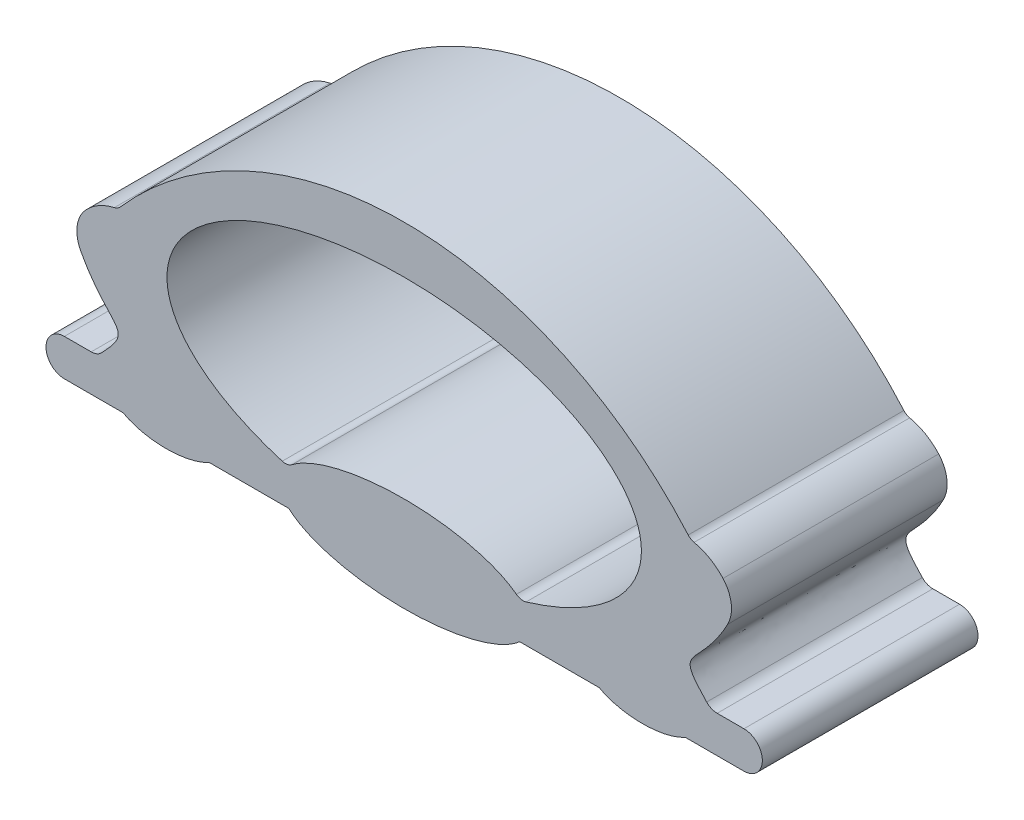
ISO-10303-21;
HEADER;
FILE_DESCRIPTION(('STEP AP214'),'2;1');
FILE_NAME('part.step','',(''),(''),'','','');
FILE_SCHEMA(('AUTOMOTIVE_DESIGN { 1 0 10303 214 1 1 1 1 }'));
ENDSEC;
DATA;
#1=APPLICATION_CONTEXT('core data for automotive mechanical design processes');
#2=APPLICATION_PROTOCOL_DEFINITION('international standard','automotive_design',2000,#1);
#3=PRODUCT_CONTEXT('',#1,'mechanical');
#4=PRODUCT('Part','Part','',(#3));
#5=PRODUCT_RELATED_PRODUCT_CATEGORY('part','',(#4));
#6=PRODUCT_DEFINITION_FORMATION('','',#4);
#7=PRODUCT_DEFINITION_CONTEXT('part definition',#1,'design');
#8=PRODUCT_DEFINITION('design','',#6,#7);
#9=PRODUCT_DEFINITION_SHAPE('','',#8);
#10=(LENGTH_UNIT() NAMED_UNIT(*) SI_UNIT(.MILLI.,.METRE.));
#11=(NAMED_UNIT(*) PLANE_ANGLE_UNIT() SI_UNIT($,.RADIAN.));
#12=(NAMED_UNIT(*) SI_UNIT($,.STERADIAN.) SOLID_ANGLE_UNIT());
#13=UNCERTAINTY_MEASURE_WITH_UNIT(LENGTH_MEASURE(1.E-05),#10,'distance_accuracy_value','');
#14=(GEOMETRIC_REPRESENTATION_CONTEXT(3) GLOBAL_UNCERTAINTY_ASSIGNED_CONTEXT((#13)) GLOBAL_UNIT_ASSIGNED_CONTEXT((#10,
#11,#12)) REPRESENTATION_CONTEXT('',''));
#15=CARTESIAN_POINT('',(0.,0.,0.));
#16=DIRECTION('',(0.,0.,1.));
#17=DIRECTION('',(1.,0.,0.));
#18=AXIS2_PLACEMENT_3D('',#15,#16,#17);
#19=CARTESIAN_POINT('',(0.,0.220517822577264,-1.));
#20=DIRECTION('',(0.,0.,1.));
#21=DIRECTION('',(1.,0.,0.));
#22=AXIS2_PLACEMENT_3D('',#19,#20,#21);
#23=ELLIPSE('',#22,0.580458558653862,0.220517822577264);
#24=DIRECTION('',(0.,0.,1.));
#25=VECTOR('',#24,1.);
#26=SURFACE_OF_LINEAR_EXTRUSION('',#23,#25);
#27=CARTESIAN_POINT('',(0.,0.220517822577264,0.));
#28=DIRECTION('',(0.,0.,1.));
#29=DIRECTION('',(1.,0.,0.));
#30=AXIS2_PLACEMENT_3D('',#27,#28,#29);
#31=ELLIPSE('',#30,0.580458558653862,0.220517822577264);
#32=CARTESIAN_POINT('',(-0.535294671074078,0.135236836832835,0.));
#33=VERTEX_POINT('',#32);
#34=CARTESIAN_POINT('',(0.535294671074078,0.135236836832835,0.));
#35=VERTEX_POINT('',#34);
#36=EDGE_CURVE('E423',#33,#35,#31,.T.);
#37=ORIENTED_EDGE('',*,*,#36,.F.);
#38=DIRECTION('',(0.,0.,1.));
#39=VECTOR('',#38,1.);
#40=CARTESIAN_POINT('',(-0.535294671074078,0.135236836832835,-1.));
#41=LINE('',#40,#39);
#42=CARTESIAN_POINT('',(-0.535294671074078,0.135236836832835,-1.));
#43=VERTEX_POINT('',#42);
#44=EDGE_CURVE('E11',#43,#33,#41,.T.);
#45=ORIENTED_EDGE('',*,*,#44,.F.);
#46=CARTESIAN_POINT('',(0.535294671074078,0.135236836832835,-1.));
#47=VERTEX_POINT('',#46);
#48=EDGE_CURVE('E393',#43,#47,#23,.T.);
#49=ORIENTED_EDGE('',*,*,#48,.T.);
#50=DIRECTION('',(0.,0.,1.));
#51=VECTOR('',#50,1.);
#52=CARTESIAN_POINT('',(0.535294671074078,0.135236836832835,-1.));
#53=LINE('',#52,#51);
#54=EDGE_CURVE('E339',#47,#35,#53,.T.);
#55=ORIENTED_EDGE('',*,*,#54,.T.);
#56=EDGE_LOOP('',(#37,#45,#49,#55));
#57=FACE_BOUND('',#56,.T.);
#58=ADVANCED_FACE('F39',(#57),#26,.T.);
#59=CARTESIAN_POINT('',(0.,0.135236836832809,-1.));
#60=DIRECTION('',(0.,-1.,0.));
#61=DIRECTION('',(1.,0.,0.));
#62=AXIS2_PLACEMENT_3D('',#59,#60,#61);
#63=PLANE('',#62);
#64=DIRECTION('',(1.,0.,0.));
#65=VECTOR('',#64,1.);
#66=CARTESIAN_POINT('',(0.,0.135236836832809,0.));
#67=LINE('',#66,#65);
#68=CARTESIAN_POINT('',(-0.904615000195535,0.135236836832853,0.));
#69=VERTEX_POINT('',#68);
#70=EDGE_CURVE('E352',#69,#33,#67,.T.);
#71=ORIENTED_EDGE('',*,*,#70,.F.);
#72=DIRECTION('',(0.,0.,1.));
#73=VECTOR('',#72,1.);
#74=CARTESIAN_POINT('',(-0.904615000195535,0.135236836832853,-1.));
#75=LINE('',#74,#73);
#76=CARTESIAN_POINT('',(-0.904615000195535,0.135236836832853,-1.));
#77=VERTEX_POINT('',#76);
#78=EDGE_CURVE('E49',#77,#69,#75,.T.);
#79=ORIENTED_EDGE('',*,*,#78,.F.);
#80=DIRECTION('',(1.,0.,0.));
#81=VECTOR('',#80,1.);
#82=CARTESIAN_POINT('',(0.,0.135236836832809,-1.));
#83=LINE('',#82,#81);
#84=EDGE_CURVE('E235',#77,#43,#83,.T.);
#85=ORIENTED_EDGE('',*,*,#84,.T.);
#86=ORIENTED_EDGE('',*,*,#44,.T.);
#87=EDGE_LOOP('',(#71,#79,#85,#86));
#88=FACE_BOUND('',#87,.T.);
#89=ADVANCED_FACE('F250',(#88),#63,.T.);
#90=CARTESIAN_POINT('',(-1.1040831308892,0.220517822577264,-1.));
#91=DIRECTION('',(0.,0.,1.));
#92=DIRECTION('',(1.,0.,0.));
#93=AXIS2_PLACEMENT_3D('',#90,#91,#92);
#94=ELLIPSE('',#93,0.264817394698102,0.129653963539522);
#95=DIRECTION('',(0.,0.,1.));
#96=VECTOR('',#95,1.);
#97=SURFACE_OF_LINEAR_EXTRUSION('',#94,#96);
#98=CARTESIAN_POINT('',(-1.1040831308892,0.220517822577264,0.));
#99=DIRECTION('',(0.,0.,1.));
#100=DIRECTION('',(1.,0.,0.));
#101=AXIS2_PLACEMENT_3D('',#98,#99,#100);
#102=ELLIPSE('',#101,0.264817394698102,0.129653963539522);
#103=CARTESIAN_POINT('',(-1.30355126158283,0.135236836832835,0.));
#104=VERTEX_POINT('',#103);
#105=EDGE_CURVE('E222',#104,#69,#102,.T.);
#106=ORIENTED_EDGE('',*,*,#105,.F.);
#107=DIRECTION('',(0.,0.,1.));
#108=VECTOR('',#107,1.);
#109=CARTESIAN_POINT('',(-1.30355126158283,0.135236836832835,-1.));
#110=LINE('',#109,#108);
#111=CARTESIAN_POINT('',(-1.30355126158283,0.135236836832835,-1.));
#112=VERTEX_POINT('',#111);
#113=EDGE_CURVE('E217',#112,#104,#110,.T.);
#114=ORIENTED_EDGE('',*,*,#113,.F.);
#115=EDGE_CURVE('E220',#112,#77,#94,.T.);
#116=ORIENTED_EDGE('',*,*,#115,.T.);
#117=ORIENTED_EDGE('',*,*,#78,.T.);
#118=EDGE_LOOP('',(#106,#114,#116,#117));
#119=FACE_BOUND('',#118,.T.);
#120=ADVANCED_FACE('F219',(#119),#97,.T.);
#121=CARTESIAN_POINT('',(0.,0.135236836832835,-1.));
#122=DIRECTION('',(0.,-1.,0.));
#123=DIRECTION('',(1.,0.,0.));
#124=AXIS2_PLACEMENT_3D('',#121,#122,#123);
#125=PLANE('',#124);
#126=DIRECTION('',(1.,0.,0.));
#127=VECTOR('',#126,1.);
#128=CARTESIAN_POINT('',(0.,0.135236836832835,0.));
#129=LINE('',#128,#127);
#130=CARTESIAN_POINT('',(-1.57560128689191,0.135236836832835,0.));
#131=VERTEX_POINT('',#130);
#132=EDGE_CURVE('E358',#131,#104,#129,.T.);
#133=ORIENTED_EDGE('',*,*,#132,.F.);
#134=DIRECTION('',(0.,0.,1.));
#135=VECTOR('',#134,1.);
#136=CARTESIAN_POINT('',(-1.57560128689191,0.135236836832835,-1.));
#137=LINE('',#136,#135);
#138=CARTESIAN_POINT('',(-1.57560128689191,0.135236836832835,-1.));
#139=VERTEX_POINT('',#138);
#140=EDGE_CURVE('E227',#139,#131,#137,.T.);
#141=ORIENTED_EDGE('',*,*,#140,.F.);
#142=DIRECTION('',(1.,0.,0.));
#143=VECTOR('',#142,1.);
#144=CARTESIAN_POINT('',(0.,0.135236836832835,-1.));
#145=LINE('',#144,#143);
#146=EDGE_CURVE('E233',#139,#112,#145,.T.);
#147=ORIENTED_EDGE('',*,*,#146,.T.);
#148=ORIENTED_EDGE('',*,*,#113,.T.);
#149=EDGE_LOOP('',(#133,#141,#147,#148));
#150=FACE_BOUND('',#149,.T.);
#151=ADVANCED_FACE('F237',(#150),#125,.T.);
#152=CARTESIAN_POINT('',(-1.57560128689191,0.220517822577264,-1.));
#153=DIRECTION('',(0.,0.,1.));
#154=DIRECTION('',(1.,0.,0.));
#155=AXIS2_PLACEMENT_3D('',#152,#153,#154);
#156=CYLINDRICAL_SURFACE('',#155,0.0852809857444291);
#157=CARTESIAN_POINT('',(-1.57560128689191,0.220517822577264,0.));
#158=DIRECTION('',(0.,0.,1.));
#159=DIRECTION('',(1.,0.,0.));
#160=AXIS2_PLACEMENT_3D('',#157,#158,#159);
#161=CIRCLE('',#160,0.0852809857444291);
#162=CARTESIAN_POINT('',(-1.57560128689191,0.305798808321693,0.));
#163=VERTEX_POINT('',#162);
#164=EDGE_CURVE('E357',#163,#131,#161,.T.);
#165=ORIENTED_EDGE('',*,*,#164,.F.);
#166=DIRECTION('',(0.,0.,1.));
#167=VECTOR('',#166,1.);
#168=CARTESIAN_POINT('',(-1.57560128689191,0.305798808321693,-1.));
#169=LINE('',#168,#167);
#170=CARTESIAN_POINT('',(-1.57560128689191,0.305798808321693,-1.));
#171=VERTEX_POINT('',#170);
#172=EDGE_CURVE('E297',#171,#163,#169,.T.);
#173=ORIENTED_EDGE('',*,*,#172,.F.);
#174=CARTESIAN_POINT('',(-1.57560128689191,0.220517822577264,-1.));
#175=DIRECTION('',(0.,0.,1.));
#176=DIRECTION('',(1.,0.,0.));
#177=AXIS2_PLACEMENT_3D('',#174,#175,#176);
#178=CIRCLE('',#177,0.0852809857444291);
#179=EDGE_CURVE('E238',#171,#139,#178,.T.);
#180=ORIENTED_EDGE('',*,*,#179,.T.);
#181=ORIENTED_EDGE('',*,*,#140,.T.);
#182=EDGE_LOOP('',(#165,#173,#180,#181));
#183=FACE_BOUND('',#182,.T.);
#184=ADVANCED_FACE('F254',(#183),#156,.T.);
#185=CARTESIAN_POINT('',(0.,0.30579880832177,-1.));
#186=DIRECTION('',(0.,-1.,0.));
#187=DIRECTION('',(1.,0.,0.));
#188=AXIS2_PLACEMENT_3D('',#185,#186,#187);
#189=PLANE('',#188);
#190=DIRECTION('',(1.,0.,0.));
#191=VECTOR('',#190,1.);
#192=CARTESIAN_POINT('',(0.,0.30579880832177,0.));
#193=LINE('',#192,#191);
#194=CARTESIAN_POINT('',(-1.45135613250542,0.305798808321699,0.));
#195=VERTEX_POINT('',#194);
#196=EDGE_CURVE('E295',#163,#195,#193,.T.);
#197=ORIENTED_EDGE('',*,*,#196,.T.);
#198=DIRECTION('',(0.,0.,1.));
#199=VECTOR('',#198,1.);
#200=CARTESIAN_POINT('',(-1.45135613250542,0.305798808321699,-1.));
#201=LINE('',#200,#199);
#202=CARTESIAN_POINT('',(-1.45135613250542,0.305798808321699,-1.));
#203=VERTEX_POINT('',#202);
#204=EDGE_CURVE('E293',#203,#195,#201,.T.);
#205=ORIENTED_EDGE('',*,*,#204,.F.);
#206=DIRECTION('',(1.,0.,0.));
#207=VECTOR('',#206,1.);
#208=CARTESIAN_POINT('',(0.,0.30579880832177,-1.));
#209=LINE('',#208,#207);
#210=EDGE_CURVE('E240',#171,#203,#209,.T.);
#211=ORIENTED_EDGE('',*,*,#210,.F.);
#212=ORIENTED_EDGE('',*,*,#172,.T.);
#213=EDGE_LOOP('',(#197,#205,#211,#212));
#214=FACE_BOUND('',#213,.T.);
#215=ADVANCED_FACE('F257',(#214),#189,.F.);
#216=CARTESIAN_POINT('',(-1.45135613250542,0.3732693463049,-1.));
#217=DIRECTION('',(0.,0.,1.));
#218=DIRECTION('',(1.,0.,0.));
#219=AXIS2_PLACEMENT_3D('',#216,#217,#218);
#220=CYLINDRICAL_SURFACE('',#219,0.0674705379832007);
#221=CARTESIAN_POINT('',(-1.45135613250542,0.3732693463049,0.));
#222=DIRECTION('',(0.,0.,1.));
#223=DIRECTION('',(1.,0.,0.));
#224=AXIS2_PLACEMENT_3D('',#221,#222,#223);
#225=CIRCLE('',#224,0.0674705379832007);
#226=CARTESIAN_POINT('',(-1.40265291356174,0.326575985317852,0.));
#227=VERTEX_POINT('',#226);
#228=EDGE_CURVE('E364',#195,#227,#225,.T.);
#229=ORIENTED_EDGE('',*,*,#228,.T.);
#230=DIRECTION('',(0.,0.,1.));
#231=VECTOR('',#230,1.);
#232=CARTESIAN_POINT('',(-1.40265291356174,0.326575985317852,-1.));
#233=LINE('',#232,#231);
#234=CARTESIAN_POINT('',(-1.40265291356174,0.326575985317852,-1.));
#235=VERTEX_POINT('',#234);
#236=EDGE_CURVE('E298',#235,#227,#233,.T.);
#237=ORIENTED_EDGE('',*,*,#236,.F.);
#238=CARTESIAN_POINT('',(-1.45135613250542,0.3732693463049,-1.));
#239=DIRECTION('',(0.,0.,1.));
#240=DIRECTION('',(1.,0.,0.));
#241=AXIS2_PLACEMENT_3D('',#238,#239,#240);
#242=CIRCLE('',#241,0.0674705379832007);
#243=EDGE_CURVE('E280',#203,#235,#242,.T.);
#244=ORIENTED_EDGE('',*,*,#243,.F.);
#245=ORIENTED_EDGE('',*,*,#204,.T.);
#246=EDGE_LOOP('',(#229,#237,#244,#245));
#247=FACE_BOUND('',#246,.T.);
#248=ADVANCED_FACE('F261',(#247),#220,.F.);
#249=CARTESIAN_POINT('',(-1.40265291356174,0.326575985317852,-1.));
#250=CARTESIAN_POINT('',(-1.36013043213884,0.370928794346584,-1.));
#251=CARTESIAN_POINT('',(-1.27309133862232,0.474573616068999,-1.));
#252=CARTESIAN_POINT('',(-1.40582243463488,0.509874509454359,-1.));
#253=CARTESIAN_POINT('',(-1.5,0.687275792162555,-1.));
#254=B_SPLINE_CURVE_WITH_KNOTS('',3,(#249,#250,#251,#252,#253),.UNSPECIFIED.,.F.,.F.,(4,1,4),
(0.0427994642491913,0.330664192356272,1.),.UNSPECIFIED.);
#255=DIRECTION('',(0.,0.,1.));
#256=VECTOR('',#255,1.);
#257=SURFACE_OF_LINEAR_EXTRUSION('',#254,#256);
#258=CARTESIAN_POINT('',(-1.40265291356174,0.326575985317852,0.));
#259=CARTESIAN_POINT('',(-1.36013043213884,0.370928794346584,0.));
#260=CARTESIAN_POINT('',(-1.27309133862232,0.474573616068999,0.));
#261=CARTESIAN_POINT('',(-1.40582243463488,0.509874509454359,0.));
#262=CARTESIAN_POINT('',(-1.5,0.687275792162555,0.));
#263=B_SPLINE_CURVE_WITH_KNOTS('',3,(#258,#259,#260,#261,#262),.UNSPECIFIED.,.F.,.F.,(4,1,4),
(0.0427994642491913,0.330664192356272,1.),.UNSPECIFIED.);
#264=CARTESIAN_POINT('',(-1.5,0.687275792162555,0.));
#265=VERTEX_POINT('',#264);
#266=EDGE_CURVE('E477',#227,#265,#263,.T.);
#267=ORIENTED_EDGE('',*,*,#266,.T.);
#268=DIRECTION('',(0.,0.,1.));
#269=VECTOR('',#268,1.);
#270=CARTESIAN_POINT('',(-1.5,0.687275792162555,-1.));
#271=LINE('',#270,#269);
#272=CARTESIAN_POINT('',(-1.5,0.687275792162555,-1.));
#273=VERTEX_POINT('',#272);
#274=EDGE_CURVE('E302',#273,#265,#271,.T.);
#275=ORIENTED_EDGE('',*,*,#274,.F.);
#276=EDGE_CURVE('E273',#235,#273,#254,.T.);
#277=ORIENTED_EDGE('',*,*,#276,.F.);
#278=ORIENTED_EDGE('',*,*,#236,.T.);
#279=EDGE_LOOP('',(#267,#275,#277,#278));
#280=FACE_BOUND('',#279,.T.);
#281=ADVANCED_FACE('F265',(#280),#257,.F.);
#282=CARTESIAN_POINT('',(-1.36534545068431,0.758760267507349,-1.));
#283=DIRECTION('',(0.,0.,1.));
#284=DIRECTION('',(1.,0.,0.));
#285=AXIS2_PLACEMENT_3D('',#282,#283,#284);
#286=CYLINDRICAL_SURFACE('',#285,0.152452870969136);
#287=CARTESIAN_POINT('',(-1.36534545068431,0.758760267507349,0.));
#288=DIRECTION('',(0.,0.,1.));
#289=DIRECTION('',(1.,0.,0.));
#290=AXIS2_PLACEMENT_3D('',#287,#288,#289);
#291=CIRCLE('',#290,0.152452870969136);
#292=CARTESIAN_POINT('',(-1.4786032866393,0.860811923356355,0.));
#293=VERTEX_POINT('',#292);
#294=EDGE_CURVE('E474',#265,#293,#291,.F.);
#295=ORIENTED_EDGE('',*,*,#294,.T.);
#296=DIRECTION('',(0.,0.,1.));
#297=VECTOR('',#296,1.);
#298=CARTESIAN_POINT('',(-1.4786032866393,0.860811923356355,-1.));
#299=LINE('',#298,#297);
#300=CARTESIAN_POINT('',(-1.4786032866393,0.860811923356355,-1.));
#301=VERTEX_POINT('',#300);
#302=EDGE_CURVE('E308',#301,#293,#299,.T.);
#303=ORIENTED_EDGE('',*,*,#302,.F.);
#304=CARTESIAN_POINT('',(-1.36534545068431,0.758760267507349,-1.));
#305=DIRECTION('',(0.,0.,1.));
#306=DIRECTION('',(1.,0.,0.));
#307=AXIS2_PLACEMENT_3D('',#304,#305,#306);
#308=CIRCLE('',#307,0.152452870969136);
#309=EDGE_CURVE('E281',#273,#301,#308,.F.);
#310=ORIENTED_EDGE('',*,*,#309,.F.);
#311=ORIENTED_EDGE('',*,*,#274,.T.);
#312=EDGE_LOOP('',(#295,#303,#310,#311));
#313=FACE_BOUND('',#312,.T.);
#314=ADVANCED_FACE('F270',(#313),#286,.T.);
#315=CARTESIAN_POINT('',(-1.29111060359085,0.691870511017601,-1.));
#316=DIRECTION('',(0.,0.,1.));
#317=DIRECTION('',(1.,0.,0.));
#318=AXIS2_PLACEMENT_3D('',#315,#316,#317);
#319=CYLINDRICAL_SURFACE('',#318,0.252378103249312);
#320=CARTESIAN_POINT('',(-1.29111060359085,0.691870511017601,0.));
#321=DIRECTION('',(0.,0.,1.));
#322=DIRECTION('',(1.,0.,0.));
#323=AXIS2_PLACEMENT_3D('',#320,#321,#322);
#324=CIRCLE('',#323,0.252378103249312);
#325=CARTESIAN_POINT('',(-1.34423413804204,0.938594237252297,0.));
#326=VERTEX_POINT('',#325);
#327=EDGE_CURVE('E471',#293,#326,#324,.F.);
#328=ORIENTED_EDGE('',*,*,#327,.T.);
#329=DIRECTION('',(0.,0.,1.));
#330=VECTOR('',#329,1.);
#331=CARTESIAN_POINT('',(-1.34423413804204,0.938594237252297,-1.));
#332=LINE('',#331,#330);
#333=CARTESIAN_POINT('',(-1.34423413804204,0.938594237252297,-1.));
#334=VERTEX_POINT('',#333);
#335=EDGE_CURVE('E311',#334,#326,#332,.T.);
#336=ORIENTED_EDGE('',*,*,#335,.F.);
#337=CARTESIAN_POINT('',(-1.29111060359085,0.691870511017601,-1.));
#338=DIRECTION('',(0.,0.,1.));
#339=DIRECTION('',(1.,0.,0.));
#340=AXIS2_PLACEMENT_3D('',#337,#338,#339);
#341=CIRCLE('',#340,0.252378103249312);
#342=EDGE_CURVE('E488',#301,#334,#341,.F.);
#343=ORIENTED_EDGE('',*,*,#342,.F.);
#344=ORIENTED_EDGE('',*,*,#302,.T.);
#345=EDGE_LOOP('',(#328,#336,#343,#344));
#346=FACE_BOUND('',#345,.T.);
#347=ADVANCED_FACE('F492',(#346),#319,.T.);
#348=CARTESIAN_POINT('',(-1.35475873066067,0.98747401783908,-1.));
#349=DIRECTION('',(0.,0.,1.));
#350=DIRECTION('',(1.,0.,0.));
#351=AXIS2_PLACEMENT_3D('',#348,#349,#350);
#352=CYLINDRICAL_SURFACE('',#351,0.0499999999999999);
#353=CARTESIAN_POINT('',(-1.35475873066067,0.98747401783908,0.));
#354=DIRECTION('',(0.,0.,1.));
#355=DIRECTION('',(1.,0.,0.));
#356=AXIS2_PLACEMENT_3D('',#353,#354,#355);
#357=CIRCLE('',#356,0.0499999999999999);
#358=CARTESIAN_POINT('',(-1.31711319517699,0.954567883788615,0.));
#359=VERTEX_POINT('',#358);
#360=EDGE_CURVE('E468',#326,#359,#357,.T.);
#361=ORIENTED_EDGE('',*,*,#360,.T.);
#362=DIRECTION('',(0.,0.,1.));
#363=VECTOR('',#362,1.);
#364=CARTESIAN_POINT('',(-1.31711319517699,0.954567883788615,-1.));
#365=LINE('',#364,#363);
#366=CARTESIAN_POINT('',(-1.31711319517699,0.954567883788615,-1.));
#367=VERTEX_POINT('',#366);
#368=EDGE_CURVE('E314',#367,#359,#365,.T.);
#369=ORIENTED_EDGE('',*,*,#368,.F.);
#370=CARTESIAN_POINT('',(-1.35475873066067,0.98747401783908,-1.));
#371=DIRECTION('',(0.,0.,1.));
#372=DIRECTION('',(1.,0.,0.));
#373=AXIS2_PLACEMENT_3D('',#370,#371,#372);
#374=CIRCLE('',#373,0.0499999999999999);
#375=EDGE_CURVE('E493',#334,#367,#374,.T.);
#376=ORIENTED_EDGE('',*,*,#375,.F.);
#377=ORIENTED_EDGE('',*,*,#335,.T.);
#378=EDGE_LOOP('',(#361,#369,#376,#377));
#379=FACE_BOUND('',#378,.T.);
#380=ADVANCED_FACE('F570',(#379),#352,.F.);
#381=CARTESIAN_POINT('',(0.,-0.196726759872993,-1.));
#382=DIRECTION('',(0.,0.,1.));
#383=DIRECTION('',(1.,0.,0.));
#384=AXIS2_PLACEMENT_3D('',#381,#382,#383);
#385=CYLINDRICAL_SURFACE('',#384,1.74936174801933);
#386=CARTESIAN_POINT('',(0.,-0.196726759872993,0.));
#387=DIRECTION('',(0.,0.,1.));
#388=DIRECTION('',(1.,0.,0.));
#389=AXIS2_PLACEMENT_3D('',#386,#387,#388);
#390=CIRCLE('',#389,1.74936174801933);
#391=CARTESIAN_POINT('',(1.31711319517699,0.954567883788615,0.));
#392=VERTEX_POINT('',#391);
#393=EDGE_CURVE('E465',#392,#359,#390,.T.);
#394=ORIENTED_EDGE('',*,*,#393,.F.);
#395=DIRECTION('',(0.,0.,1.));
#396=VECTOR('',#395,1.);
#397=CARTESIAN_POINT('',(1.31711319517699,0.954567883788615,-1.));
#398=LINE('',#397,#396);
#399=CARTESIAN_POINT('',(1.31711319517699,0.954567883788615,-1.));
#400=VERTEX_POINT('',#399);
#401=EDGE_CURVE('E316',#400,#392,#398,.T.);
#402=ORIENTED_EDGE('',*,*,#401,.F.);
#403=CARTESIAN_POINT('',(0.,-0.196726759872993,-1.));
#404=DIRECTION('',(0.,0.,1.));
#405=DIRECTION('',(1.,0.,0.));
#406=AXIS2_PLACEMENT_3D('',#403,#404,#405);
#407=CIRCLE('',#406,1.74936174801933);
#408=EDGE_CURVE('E494',#400,#367,#407,.T.);
#409=ORIENTED_EDGE('',*,*,#408,.T.);
#410=ORIENTED_EDGE('',*,*,#368,.T.);
#411=EDGE_LOOP('',(#394,#402,#409,#410));
#412=FACE_BOUND('',#411,.T.);
#413=ADVANCED_FACE('F567',(#412),#385,.T.);
#414=CARTESIAN_POINT('',(1.35475873066067,0.98747401783908,-1.));
#415=DIRECTION('',(0.,0.,1.));
#416=DIRECTION('',(1.,0.,0.));
#417=AXIS2_PLACEMENT_3D('',#414,#415,#416);
#418=CYLINDRICAL_SURFACE('',#417,0.0499999999999999);
#419=CARTESIAN_POINT('',(1.35475873066067,0.98747401783908,0.));
#420=DIRECTION('',(0.,0.,1.));
#421=DIRECTION('',(1.,0.,0.));
#422=AXIS2_PLACEMENT_3D('',#419,#420,#421);
#423=CIRCLE('',#422,0.0499999999999999);
#424=CARTESIAN_POINT('',(1.34423413804204,0.938594237252297,0.));
#425=VERTEX_POINT('',#424);
#426=EDGE_CURVE('E462',#425,#392,#423,.F.);
#427=ORIENTED_EDGE('',*,*,#426,.F.);
#428=DIRECTION('',(0.,0.,1.));
#429=VECTOR('',#428,1.);
#430=CARTESIAN_POINT('',(1.34423413804204,0.938594237252297,-1.));
#431=LINE('',#430,#429);
#432=CARTESIAN_POINT('',(1.34423413804204,0.938594237252297,-1.));
#433=VERTEX_POINT('',#432);
#434=EDGE_CURVE('E318',#433,#425,#431,.T.);
#435=ORIENTED_EDGE('',*,*,#434,.F.);
#436=CARTESIAN_POINT('',(1.35475873066067,0.98747401783908,-1.));
#437=DIRECTION('',(0.,0.,1.));
#438=DIRECTION('',(1.,0.,0.));
#439=AXIS2_PLACEMENT_3D('',#436,#437,#438);
#440=CIRCLE('',#439,0.0499999999999999);
#441=EDGE_CURVE('E499',#433,#400,#440,.F.);
#442=ORIENTED_EDGE('',*,*,#441,.T.);
#443=ORIENTED_EDGE('',*,*,#401,.T.);
#444=EDGE_LOOP('',(#427,#435,#442,#443));
#445=FACE_BOUND('',#444,.T.);
#446=ADVANCED_FACE('F563',(#445),#418,.F.);
#447=CARTESIAN_POINT('',(1.29111060359085,0.691870511017601,-1.));
#448=DIRECTION('',(0.,0.,1.));
#449=DIRECTION('',(1.,0.,0.));
#450=AXIS2_PLACEMENT_3D('',#447,#448,#449);
#451=CYLINDRICAL_SURFACE('',#450,0.252378103249312);
#452=CARTESIAN_POINT('',(1.29111060359085,0.691870511017601,0.));
#453=DIRECTION('',(0.,0.,1.));
#454=DIRECTION('',(1.,0.,0.));
#455=AXIS2_PLACEMENT_3D('',#452,#453,#454);
#456=CIRCLE('',#455,0.252378103249312);
#457=CARTESIAN_POINT('',(1.4786032866393,0.860811923356355,0.));
#458=VERTEX_POINT('',#457);
#459=EDGE_CURVE('E459',#458,#425,#456,.T.);
#460=ORIENTED_EDGE('',*,*,#459,.F.);
#461=DIRECTION('',(0.,0.,1.));
#462=VECTOR('',#461,1.);
#463=CARTESIAN_POINT('',(1.4786032866393,0.860811923356355,-1.));
#464=LINE('',#463,#462);
#465=CARTESIAN_POINT('',(1.4786032866393,0.860811923356355,-1.));
#466=VERTEX_POINT('',#465);
#467=EDGE_CURVE('E320',#466,#458,#464,.T.);
#468=ORIENTED_EDGE('',*,*,#467,.F.);
#469=CARTESIAN_POINT('',(1.29111060359085,0.691870511017601,-1.));
#470=DIRECTION('',(0.,0.,1.));
#471=DIRECTION('',(1.,0.,0.));
#472=AXIS2_PLACEMENT_3D('',#469,#470,#471);
#473=CIRCLE('',#472,0.252378103249312);
#474=EDGE_CURVE('E502',#466,#433,#473,.T.);
#475=ORIENTED_EDGE('',*,*,#474,.T.);
#476=ORIENTED_EDGE('',*,*,#434,.T.);
#477=EDGE_LOOP('',(#460,#468,#475,#476));
#478=FACE_BOUND('',#477,.T.);
#479=ADVANCED_FACE('F559',(#478),#451,.T.);
#480=CARTESIAN_POINT('',(1.36534545068431,0.758760267507349,-1.));
#481=DIRECTION('',(0.,0.,1.));
#482=DIRECTION('',(1.,0.,0.));
#483=AXIS2_PLACEMENT_3D('',#480,#481,#482);
#484=CYLINDRICAL_SURFACE('',#483,0.152452870969136);
#485=CARTESIAN_POINT('',(1.36534545068431,0.758760267507349,0.));
#486=DIRECTION('',(0.,0.,1.));
#487=DIRECTION('',(1.,0.,0.));
#488=AXIS2_PLACEMENT_3D('',#485,#486,#487);
#489=CIRCLE('',#488,0.152452870969136);
#490=CARTESIAN_POINT('',(1.5,0.687275792162555,0.));
#491=VERTEX_POINT('',#490);
#492=EDGE_CURVE('E453',#491,#458,#489,.T.);
#493=ORIENTED_EDGE('',*,*,#492,.F.);
#494=DIRECTION('',(0.,0.,1.));
#495=VECTOR('',#494,1.);
#496=CARTESIAN_POINT('',(1.5,0.687275792162555,-1.));
#497=LINE('',#496,#495);
#498=CARTESIAN_POINT('',(1.5,0.687275792162555,-1.));
#499=VERTEX_POINT('',#498);
#500=EDGE_CURVE('E322',#499,#491,#497,.T.);
#501=ORIENTED_EDGE('',*,*,#500,.F.);
#502=CARTESIAN_POINT('',(1.36534545068431,0.758760267507349,-1.));
#503=DIRECTION('',(0.,0.,1.));
#504=DIRECTION('',(1.,0.,0.));
#505=AXIS2_PLACEMENT_3D('',#502,#503,#504);
#506=CIRCLE('',#505,0.152452870969136);
#507=EDGE_CURVE('E505',#499,#466,#506,.T.);
#508=ORIENTED_EDGE('',*,*,#507,.T.);
#509=ORIENTED_EDGE('',*,*,#467,.T.);
#510=EDGE_LOOP('',(#493,#501,#508,#509));
#511=FACE_BOUND('',#510,.T.);
#512=ADVANCED_FACE('F525',(#511),#484,.T.);
#513=CARTESIAN_POINT('',(1.40265291356174,0.326575985317852,-1.));
#514=CARTESIAN_POINT('',(1.36013043213884,0.370928794346584,-1.));
#515=CARTESIAN_POINT('',(1.27309133862232,0.474573616068999,-1.));
#516=CARTESIAN_POINT('',(1.40582243463488,0.509874509454359,-1.));
#517=CARTESIAN_POINT('',(1.5,0.687275792162555,-1.));
#518=B_SPLINE_CURVE_WITH_KNOTS('',3,(#513,#514,#515,#516,#517),.UNSPECIFIED.,.F.,.F.,(4,1,4),
(0.0427994642491913,0.330664192356272,1.),.UNSPECIFIED.);
#519=DIRECTION('',(0.,0.,1.));
#520=VECTOR('',#519,1.);
#521=SURFACE_OF_LINEAR_EXTRUSION('',#518,#520);
#522=CARTESIAN_POINT('',(1.40265291356174,0.326575985317852,0.));
#523=CARTESIAN_POINT('',(1.36013043213884,0.370928794346584,0.));
#524=CARTESIAN_POINT('',(1.27309133862232,0.474573616068999,0.));
#525=CARTESIAN_POINT('',(1.40582243463488,0.509874509454359,0.));
#526=CARTESIAN_POINT('',(1.5,0.687275792162555,0.));
#527=B_SPLINE_CURVE_WITH_KNOTS('',3,(#522,#523,#524,#525,#526),.UNSPECIFIED.,.F.,.F.,(4,1,4),
(0.0427994642491913,0.330664192356272,1.),.UNSPECIFIED.);
#528=CARTESIAN_POINT('',(1.40265291356174,0.326575985317852,0.));
#529=VERTEX_POINT('',#528);
#530=EDGE_CURVE('E448',#529,#491,#527,.T.);
#531=ORIENTED_EDGE('',*,*,#530,.F.);
#532=DIRECTION('',(0.,0.,1.));
#533=VECTOR('',#532,1.);
#534=CARTESIAN_POINT('',(1.40265291356174,0.326575985317852,-1.));
#535=LINE('',#534,#533);
#536=CARTESIAN_POINT('',(1.40265291356174,0.326575985317852,-1.));
#537=VERTEX_POINT('',#536);
#538=EDGE_CURVE('E324',#537,#529,#535,.T.);
#539=ORIENTED_EDGE('',*,*,#538,.F.);
#540=EDGE_CURVE('E508',#537,#499,#518,.T.);
#541=ORIENTED_EDGE('',*,*,#540,.T.);
#542=ORIENTED_EDGE('',*,*,#500,.T.);
#543=EDGE_LOOP('',(#531,#539,#541,#542));
#544=FACE_BOUND('',#543,.T.);
#545=ADVANCED_FACE('F520',(#544),#521,.T.);
#546=CARTESIAN_POINT('',(1.45135613250542,0.3732693463049,-1.));
#547=DIRECTION('',(0.,0.,1.));
#548=DIRECTION('',(1.,0.,0.));
#549=AXIS2_PLACEMENT_3D('',#546,#547,#548);
#550=CYLINDRICAL_SURFACE('',#549,0.0674705379832007);
#551=CARTESIAN_POINT('',(1.45135613250542,0.3732693463049,0.));
#552=DIRECTION('',(0.,0.,1.));
#553=DIRECTION('',(1.,0.,0.));
#554=AXIS2_PLACEMENT_3D('',#551,#552,#553);
#555=CIRCLE('',#554,0.0674705379832007);
#556=CARTESIAN_POINT('',(1.45135613250542,0.305798808321699,0.));
#557=VERTEX_POINT('',#556);
#558=EDGE_CURVE('E445',#557,#529,#555,.F.);
#559=ORIENTED_EDGE('',*,*,#558,.F.);
#560=DIRECTION('',(0.,0.,1.));
#561=VECTOR('',#560,1.);
#562=CARTESIAN_POINT('',(1.45135613250542,0.305798808321699,-1.));
#563=LINE('',#562,#561);
#564=CARTESIAN_POINT('',(1.45135613250542,0.305798808321699,-1.));
#565=VERTEX_POINT('',#564);
#566=EDGE_CURVE('E326',#565,#557,#563,.T.);
#567=ORIENTED_EDGE('',*,*,#566,.F.);
#568=CARTESIAN_POINT('',(1.45135613250542,0.3732693463049,-1.));
#569=DIRECTION('',(0.,0.,1.));
#570=DIRECTION('',(1.,0.,0.));
#571=AXIS2_PLACEMENT_3D('',#568,#569,#570);
#572=CIRCLE('',#571,0.0674705379832007);
#573=EDGE_CURVE('E514',#565,#537,#572,.F.);
#574=ORIENTED_EDGE('',*,*,#573,.T.);
#575=ORIENTED_EDGE('',*,*,#538,.T.);
#576=EDGE_LOOP('',(#559,#567,#574,#575));
#577=FACE_BOUND('',#576,.T.);
#578=ADVANCED_FACE('F524',(#577),#550,.F.);
#579=CARTESIAN_POINT('',(0.,0.30579880832177,-1.));
#580=DIRECTION('',(0.,1.,0.));
#581=DIRECTION('',(-1.,0.,0.));
#582=AXIS2_PLACEMENT_3D('',#579,#580,#581);
#583=PLANE('',#582);
#584=DIRECTION('',(-1.,0.,0.));
#585=VECTOR('',#584,1.);
#586=CARTESIAN_POINT('',(0.,0.30579880832177,0.));
#587=LINE('',#586,#585);
#588=CARTESIAN_POINT('',(1.57560128689191,0.305798808321693,0.));
#589=VERTEX_POINT('',#588);
#590=EDGE_CURVE('E442',#589,#557,#587,.T.);
#591=ORIENTED_EDGE('',*,*,#590,.F.);
#592=DIRECTION('',(0.,0.,1.));
#593=VECTOR('',#592,1.);
#594=CARTESIAN_POINT('',(1.57560128689191,0.305798808321693,-1.));
#595=LINE('',#594,#593);
#596=CARTESIAN_POINT('',(1.57560128689191,0.305798808321693,-1.));
#597=VERTEX_POINT('',#596);
#598=EDGE_CURVE('E328',#597,#589,#595,.T.);
#599=ORIENTED_EDGE('',*,*,#598,.F.);
#600=DIRECTION('',(-1.,0.,0.));
#601=VECTOR('',#600,1.);
#602=CARTESIAN_POINT('',(0.,0.30579880832177,-1.));
#603=LINE('',#602,#601);
#604=EDGE_CURVE('E548',#597,#565,#603,.T.);
#605=ORIENTED_EDGE('',*,*,#604,.T.);
#606=ORIENTED_EDGE('',*,*,#566,.T.);
#607=EDGE_LOOP('',(#591,#599,#605,#606));
#608=FACE_BOUND('',#607,.T.);
#609=ADVANCED_FACE('F530',(#608),#583,.T.);
#610=CARTESIAN_POINT('',(1.57560128689191,0.220517822577264,-1.));
#611=DIRECTION('',(0.,0.,1.));
#612=DIRECTION('',(1.,0.,0.));
#613=AXIS2_PLACEMENT_3D('',#610,#611,#612);
#614=CYLINDRICAL_SURFACE('',#613,0.0852809857444291);
#615=CARTESIAN_POINT('',(1.57560128689191,0.220517822577264,0.));
#616=DIRECTION('',(0.,0.,1.));
#617=DIRECTION('',(1.,0.,0.));
#618=AXIS2_PLACEMENT_3D('',#615,#616,#617);
#619=CIRCLE('',#618,0.0852809857444291);
#620=CARTESIAN_POINT('',(1.57560128689191,0.135236836832835,0.));
#621=VERTEX_POINT('',#620);
#622=EDGE_CURVE('E439',#589,#621,#619,.F.);
#623=ORIENTED_EDGE('',*,*,#622,.T.);
#624=DIRECTION('',(0.,0.,1.));
#625=VECTOR('',#624,1.);
#626=CARTESIAN_POINT('',(1.57560128689191,0.135236836832835,-1.));
#627=LINE('',#626,#625);
#628=CARTESIAN_POINT('',(1.57560128689191,0.135236836832835,-1.));
#629=VERTEX_POINT('',#628);
#630=EDGE_CURVE('E330',#629,#621,#627,.T.);
#631=ORIENTED_EDGE('',*,*,#630,.F.);
#632=CARTESIAN_POINT('',(1.57560128689191,0.220517822577264,-1.));
#633=DIRECTION('',(0.,0.,1.));
#634=DIRECTION('',(1.,0.,0.));
#635=AXIS2_PLACEMENT_3D('',#632,#633,#634);
#636=CIRCLE('',#635,0.0852809857444291);
#637=EDGE_CURVE('E571',#597,#629,#636,.F.);
#638=ORIENTED_EDGE('',*,*,#637,.F.);
#639=ORIENTED_EDGE('',*,*,#598,.T.);
#640=EDGE_LOOP('',(#623,#631,#638,#639));
#641=FACE_BOUND('',#640,.T.);
#642=ADVANCED_FACE('F533',(#641),#614,.T.);
#643=CARTESIAN_POINT('',(0.,0.135236836832835,-1.));
#644=DIRECTION('',(0.,1.,0.));
#645=DIRECTION('',(-1.,0.,0.));
#646=AXIS2_PLACEMENT_3D('',#643,#644,#645);
#647=PLANE('',#646);
#648=DIRECTION('',(-1.,0.,0.));
#649=VECTOR('',#648,1.);
#650=CARTESIAN_POINT('',(0.,0.135236836832835,0.));
#651=LINE('',#650,#649);
#652=CARTESIAN_POINT('',(1.30355126158283,0.135236836832835,0.));
#653=VERTEX_POINT('',#652);
#654=EDGE_CURVE('E436',#621,#653,#651,.T.);
#655=ORIENTED_EDGE('',*,*,#654,.T.);
#656=DIRECTION('',(0.,0.,1.));
#657=VECTOR('',#656,1.);
#658=CARTESIAN_POINT('',(1.30355126158283,0.135236836832835,-1.));
#659=LINE('',#658,#657);
#660=CARTESIAN_POINT('',(1.30355126158283,0.135236836832835,-1.));
#661=VERTEX_POINT('',#660);
#662=EDGE_CURVE('E333',#661,#653,#659,.T.);
#663=ORIENTED_EDGE('',*,*,#662,.F.);
#664=DIRECTION('',(-1.,0.,0.));
#665=VECTOR('',#664,1.);
#666=CARTESIAN_POINT('',(0.,0.135236836832835,-1.));
#667=LINE('',#666,#665);
#668=EDGE_CURVE('E402',#629,#661,#667,.T.);
#669=ORIENTED_EDGE('',*,*,#668,.F.);
#670=ORIENTED_EDGE('',*,*,#630,.T.);
#671=EDGE_LOOP('',(#655,#663,#669,#670));
#672=FACE_BOUND('',#671,.T.);
#673=ADVANCED_FACE('F408',(#672),#647,.F.);
#674=CARTESIAN_POINT('',(1.1040831308892,0.220517822577264,-1.));
#675=DIRECTION('',(0.,0.,-1.));
#676=DIRECTION('',(-1.,0.,0.));
#677=AXIS2_PLACEMENT_3D('',#674,#675,#676);
#678=ELLIPSE('',#677,0.264817394698102,0.129653963539523);
#679=DIRECTION('',(0.,0.,1.));
#680=VECTOR('',#679,1.);
#681=SURFACE_OF_LINEAR_EXTRUSION('',#678,#680);
#682=CARTESIAN_POINT('',(1.1040831308892,0.220517822577264,0.));
#683=DIRECTION('',(0.,0.,-1.));
#684=DIRECTION('',(-1.,0.,0.));
#685=AXIS2_PLACEMENT_3D('',#682,#683,#684);
#686=ELLIPSE('',#685,0.264817394698102,0.129653963539523);
#687=CARTESIAN_POINT('',(0.904615000195535,0.135236836832853,0.));
#688=VERTEX_POINT('',#687);
#689=EDGE_CURVE('E428',#653,#688,#686,.T.);
#690=ORIENTED_EDGE('',*,*,#689,.T.);
#691=DIRECTION('',(0.,0.,1.));
#692=VECTOR('',#691,1.);
#693=CARTESIAN_POINT('',(0.904615000195535,0.135236836832853,-1.));
#694=LINE('',#693,#692);
#695=CARTESIAN_POINT('',(0.904615000195535,0.135236836832853,-1.));
#696=VERTEX_POINT('',#695);
#697=EDGE_CURVE('E336',#696,#688,#694,.T.);
#698=ORIENTED_EDGE('',*,*,#697,.F.);
#699=EDGE_CURVE('E398',#661,#696,#678,.T.);
#700=ORIENTED_EDGE('',*,*,#699,.F.);
#701=ORIENTED_EDGE('',*,*,#662,.T.);
#702=EDGE_LOOP('',(#690,#698,#700,#701));
#703=FACE_BOUND('',#702,.T.);
#704=ADVANCED_FACE('F405',(#703),#681,.F.);
#705=CARTESIAN_POINT('',(0.55099028542075,0.357752952271063,-1.));
#706=DIRECTION('',(0.,0.,1.));
#707=DIRECTION('',(1.,0.,0.));
#708=AXIS2_PLACEMENT_3D('',#705,#706,#707);
#709=CYLINDRICAL_SURFACE('',#708,0.05);
#710=CARTESIAN_POINT('',(0.55099028542075,0.357752952271063,0.));
#711=DIRECTION('',(0.,0.,1.));
#712=DIRECTION('',(1.,0.,0.));
#713=AXIS2_PLACEMENT_3D('',#710,#711,#712);
#714=CIRCLE('',#713,0.05);
#715=CARTESIAN_POINT('',(0.565338464899144,0.309855877771092,0.));
#716=VERTEX_POINT('',#715);
#717=CARTESIAN_POINT('',(0.520495625253044,0.318128771506584,0.));
#718=VERTEX_POINT('',#717);
#719=EDGE_CURVE('E819',#716,#718,#714,.F.);
#720=ORIENTED_EDGE('',*,*,#719,.F.);
#721=DIRECTION('',(0.,0.,1.));
#722=VECTOR('',#721,1.);
#723=CARTESIAN_POINT('',(0.565338464899144,0.309855877771092,-1.));
#724=LINE('',#723,#722);
#725=CARTESIAN_POINT('',(0.565338464899144,0.309855877771092,-1.));
#726=VERTEX_POINT('',#725);
#727=EDGE_CURVE('E341',#726,#716,#724,.T.);
#728=ORIENTED_EDGE('',*,*,#727,.F.);
#729=CARTESIAN_POINT('',(0.55099028542075,0.357752952271063,-1.));
#730=DIRECTION('',(0.,0.,1.));
#731=DIRECTION('',(1.,0.,0.));
#732=AXIS2_PLACEMENT_3D('',#729,#730,#731);
#733=CIRCLE('',#732,0.05);
#734=CARTESIAN_POINT('',(0.520495625253044,0.318128771506584,-1.));
#735=VERTEX_POINT('',#734);
#736=EDGE_CURVE('E368',#726,#735,#733,.F.);
#737=ORIENTED_EDGE('',*,*,#736,.T.);
#738=DIRECTION('',(0.,0.,1.));
#739=VECTOR('',#738,1.);
#740=CARTESIAN_POINT('',(0.520495625253044,0.318128771506584,-1.));
#741=LINE('',#740,#739);
#742=EDGE_CURVE('E43',#735,#718,#741,.T.);
#743=ORIENTED_EDGE('',*,*,#742,.T.);
#744=EDGE_LOOP('',(#720,#728,#737,#743));
#745=FACE_BOUND('',#744,.T.);
#746=ADVANCED_FACE('F41',(#745),#709,.F.);
#747=CARTESIAN_POINT('',(0.,0.781658914033439,-1.));
#748=DIRECTION('',(0.,0.,1.));
#749=DIRECTION('',(1.,0.,0.));
#750=AXIS2_PLACEMENT_3D('',#747,#748,#749);
#751=ELLIPSE('',#750,1.1,0.55);
#752=DIRECTION('',(0.,0.,1.));
#753=VECTOR('',#752,1.);
#754=SURFACE_OF_LINEAR_EXTRUSION('',#751,#753);
#755=CARTESIAN_POINT('',(0.,0.781658914033439,0.));
#756=DIRECTION('',(0.,0.,1.));
#757=DIRECTION('',(1.,0.,0.));
#758=AXIS2_PLACEMENT_3D('',#755,#756,#757);
#759=ELLIPSE('',#758,1.1,0.55);
#760=CARTESIAN_POINT('',(-0.565338464899144,0.309855877771092,0.));
#761=VERTEX_POINT('',#760);
#762=EDGE_CURVE('E426',#716,#761,#759,.T.);
#763=ORIENTED_EDGE('',*,*,#762,.T.);
#764=DIRECTION('',(0.,0.,1.));
#765=VECTOR('',#764,1.);
#766=CARTESIAN_POINT('',(-0.565338464899144,0.309855877771092,-1.));
#767=LINE('',#766,#765);
#768=CARTESIAN_POINT('',(-0.565338464899144,0.309855877771092,-1.));
#769=VERTEX_POINT('',#768);
#770=EDGE_CURVE('E343',#769,#761,#767,.T.);
#771=ORIENTED_EDGE('',*,*,#770,.F.);
#772=EDGE_CURVE('E391',#726,#769,#751,.T.);
#773=ORIENTED_EDGE('',*,*,#772,.F.);
#774=ORIENTED_EDGE('',*,*,#727,.T.);
#775=EDGE_LOOP('',(#763,#771,#773,#774));
#776=FACE_BOUND('',#775,.T.);
#777=ADVANCED_FACE('F384',(#776),#754,.F.);
#778=CARTESIAN_POINT('',(-0.55099028542075,0.357752952271063,-1.));
#779=DIRECTION('',(0.,0.,1.));
#780=DIRECTION('',(1.,0.,0.));
#781=AXIS2_PLACEMENT_3D('',#778,#779,#780);
#782=CYLINDRICAL_SURFACE('',#781,0.05);
#783=CARTESIAN_POINT('',(-0.55099028542075,0.357752952271063,0.));
#784=DIRECTION('',(0.,0.,1.));
#785=DIRECTION('',(1.,0.,0.));
#786=AXIS2_PLACEMENT_3D('',#783,#784,#785);
#787=CIRCLE('',#786,0.05);
#788=CARTESIAN_POINT('',(-0.520495625253044,0.318128771506584,0.));
#789=VERTEX_POINT('',#788);
#790=EDGE_CURVE('E430',#761,#789,#787,.T.);
#791=ORIENTED_EDGE('',*,*,#790,.T.);
#792=DIRECTION('',(0.,0.,1.));
#793=VECTOR('',#792,1.);
#794=CARTESIAN_POINT('',(-0.520495625253044,0.318128771506584,-1.));
#795=LINE('',#794,#793);
#796=CARTESIAN_POINT('',(-0.520495625253044,0.318128771506584,-1.));
#797=VERTEX_POINT('',#796);
#798=EDGE_CURVE('E345',#797,#789,#795,.T.);
#799=ORIENTED_EDGE('',*,*,#798,.F.);
#800=CARTESIAN_POINT('',(-0.55099028542075,0.357752952271063,-1.));
#801=DIRECTION('',(0.,0.,1.));
#802=DIRECTION('',(1.,0.,0.));
#803=AXIS2_PLACEMENT_3D('',#800,#801,#802);
#804=CIRCLE('',#803,0.05);
#805=EDGE_CURVE('E372',#769,#797,#804,.T.);
#806=ORIENTED_EDGE('',*,*,#805,.F.);
#807=ORIENTED_EDGE('',*,*,#770,.T.);
#808=EDGE_LOOP('',(#791,#799,#806,#807));
#809=FACE_BOUND('',#808,.T.);
#810=ADVANCED_FACE('F381',(#809),#782,.F.);
#811=CARTESIAN_POINT('',(0.,0.220517822577264,-1.));
#812=DIRECTION('',(0.,0.,1.));
#813=DIRECTION('',(1.,0.,0.));
#814=AXIS2_PLACEMENT_3D('',#811,#812,#813);
#815=ELLIPSE('',#814,0.580458558653862,0.220517822577264);
#816=DIRECTION('',(0.,0.,1.));
#817=VECTOR('',#816,1.);
#818=SURFACE_OF_LINEAR_EXTRUSION('',#815,#817);
#819=CARTESIAN_POINT('',(0.,0.220517822577264,0.));
#820=DIRECTION('',(0.,0.,1.));
#821=DIRECTION('',(1.,0.,0.));
#822=AXIS2_PLACEMENT_3D('',#819,#820,#821);
#823=ELLIPSE('',#822,0.580458558653862,0.220517822577264);
#824=EDGE_CURVE('E821',#718,#789,#823,.T.);
#825=ORIENTED_EDGE('',*,*,#824,.F.);
#826=ORIENTED_EDGE('',*,*,#742,.F.);
#827=EDGE_CURVE('E369',#735,#797,#815,.T.);
#828=ORIENTED_EDGE('',*,*,#827,.T.);
#829=ORIENTED_EDGE('',*,*,#798,.T.);
#830=EDGE_LOOP('',(#825,#826,#828,#829));
#831=FACE_BOUND('',#830,.T.);
#832=ADVANCED_FACE('F377',(#831),#818,.T.);
#833=CARTESIAN_POINT('',(0.,0.135236836832809,-1.));
#834=DIRECTION('',(0.,1.,0.));
#835=DIRECTION('',(-1.,0.,0.));
#836=AXIS2_PLACEMENT_3D('',#833,#834,#835);
#837=PLANE('',#836);
#838=DIRECTION('',(-1.,0.,0.));
#839=VECTOR('',#838,1.);
#840=CARTESIAN_POINT('',(0.,0.135236836832809,0.));
#841=LINE('',#840,#839);
#842=EDGE_CURVE('E425',#688,#35,#841,.T.);
#843=ORIENTED_EDGE('',*,*,#842,.T.);
#844=ORIENTED_EDGE('',*,*,#54,.F.);
#845=DIRECTION('',(-1.,0.,0.));
#846=VECTOR('',#845,1.);
#847=CARTESIAN_POINT('',(0.,0.135236836832809,-1.));
#848=LINE('',#847,#846);
#849=EDGE_CURVE('E396',#696,#47,#848,.T.);
#850=ORIENTED_EDGE('',*,*,#849,.F.);
#851=ORIENTED_EDGE('',*,*,#697,.T.);
#852=EDGE_LOOP('',(#843,#844,#850,#851));
#853=FACE_BOUND('',#852,.T.);
#854=ADVANCED_FACE('F380',(#853),#837,.F.);
#855=CARTESIAN_POINT('',(0.,0.,-1.));
#856=DIRECTION('',(0.,0.,1.));
#857=DIRECTION('',(1.,0.,0.));
#858=AXIS2_PLACEMENT_3D('',#855,#856,#857);
#859=PLANE('',#858);
#860=ORIENTED_EDGE('',*,*,#736,.F.);
#861=ORIENTED_EDGE('',*,*,#772,.T.);
#862=ORIENTED_EDGE('',*,*,#805,.T.);
#863=ORIENTED_EDGE('',*,*,#827,.F.);
#864=EDGE_LOOP('',(#860,#861,#862,#863));
#865=FACE_BOUND('',#864,.T.);
#866=ORIENTED_EDGE('',*,*,#48,.F.);
#867=ORIENTED_EDGE('',*,*,#84,.F.);
#868=ORIENTED_EDGE('',*,*,#115,.F.);
#869=ORIENTED_EDGE('',*,*,#146,.F.);
#870=ORIENTED_EDGE('',*,*,#179,.F.);
#871=ORIENTED_EDGE('',*,*,#210,.T.);
#872=ORIENTED_EDGE('',*,*,#243,.T.);
#873=ORIENTED_EDGE('',*,*,#276,.T.);
#874=ORIENTED_EDGE('',*,*,#309,.T.);
#875=ORIENTED_EDGE('',*,*,#342,.T.);
#876=ORIENTED_EDGE('',*,*,#375,.T.);
#877=ORIENTED_EDGE('',*,*,#408,.F.);
#878=ORIENTED_EDGE('',*,*,#441,.F.);
#879=ORIENTED_EDGE('',*,*,#474,.F.);
#880=ORIENTED_EDGE('',*,*,#507,.F.);
#881=ORIENTED_EDGE('',*,*,#540,.F.);
#882=ORIENTED_EDGE('',*,*,#573,.F.);
#883=ORIENTED_EDGE('',*,*,#604,.F.);
#884=ORIENTED_EDGE('',*,*,#637,.T.);
#885=ORIENTED_EDGE('',*,*,#668,.T.);
#886=ORIENTED_EDGE('',*,*,#699,.T.);
#887=ORIENTED_EDGE('',*,*,#849,.T.);
#888=EDGE_LOOP('',(#866,#867,#868,#869,#870,#871,#872,#873,#874,#875,#876,#877,#878,#879,#880,
#881,#882,#883,#884,#885,#886,#887));
#889=FACE_BOUND('',#888,.T.);
#890=ADVANCED_FACE('F231',(#865,#889),#859,.F.);
#891=CARTESIAN_POINT('',(0.,0.,0.));
#892=DIRECTION('',(0.,0.,1.));
#893=DIRECTION('',(1.,0.,0.));
#894=AXIS2_PLACEMENT_3D('',#891,#892,#893);
#895=PLANE('',#894);
#896=ORIENTED_EDGE('',*,*,#719,.T.);
#897=ORIENTED_EDGE('',*,*,#824,.T.);
#898=ORIENTED_EDGE('',*,*,#790,.F.);
#899=ORIENTED_EDGE('',*,*,#762,.F.);
#900=EDGE_LOOP('',(#896,#897,#898,#899));
#901=FACE_BOUND('',#900,.T.);
#902=ORIENTED_EDGE('',*,*,#36,.T.);
#903=ORIENTED_EDGE('',*,*,#842,.F.);
#904=ORIENTED_EDGE('',*,*,#689,.F.);
#905=ORIENTED_EDGE('',*,*,#654,.F.);
#906=ORIENTED_EDGE('',*,*,#622,.F.);
#907=ORIENTED_EDGE('',*,*,#590,.T.);
#908=ORIENTED_EDGE('',*,*,#558,.T.);
#909=ORIENTED_EDGE('',*,*,#530,.T.);
#910=ORIENTED_EDGE('',*,*,#492,.T.);
#911=ORIENTED_EDGE('',*,*,#459,.T.);
#912=ORIENTED_EDGE('',*,*,#426,.T.);
#913=ORIENTED_EDGE('',*,*,#393,.T.);
#914=ORIENTED_EDGE('',*,*,#360,.F.);
#915=ORIENTED_EDGE('',*,*,#327,.F.);
#916=ORIENTED_EDGE('',*,*,#294,.F.);
#917=ORIENTED_EDGE('',*,*,#266,.F.);
#918=ORIENTED_EDGE('',*,*,#228,.F.);
#919=ORIENTED_EDGE('',*,*,#196,.F.);
#920=ORIENTED_EDGE('',*,*,#164,.T.);
#921=ORIENTED_EDGE('',*,*,#132,.T.);
#922=ORIENTED_EDGE('',*,*,#105,.T.);
#923=ORIENTED_EDGE('',*,*,#70,.T.);
#924=EDGE_LOOP('',(#902,#903,#904,#905,#906,#907,#908,#909,#910,#911,#912,#913,#914,#915,#916,
#917,#918,#919,#920,#921,#922,#923));
#925=FACE_BOUND('',#924,.T.);
#926=ADVANCED_FACE('F362',(#901,#925),#895,.T.);
#927=CLOSED_SHELL('',(#58,#89,#120,#151,#184,#215,#248,#281,#314,#347,#380,#413,#446,#479,#512,
#545,#578,#609,#642,#673,#704,#746,#777,#810,#832,#854,#890,#926));
#928=MANIFOLD_SOLID_BREP('B2',#927);
#929=ADVANCED_BREP_SHAPE_REPRESENTATION('',(#18,#928),#14);
#930=SHAPE_DEFINITION_REPRESENTATION(#9,#929);
ENDSEC;
END-ISO-10303-21;
